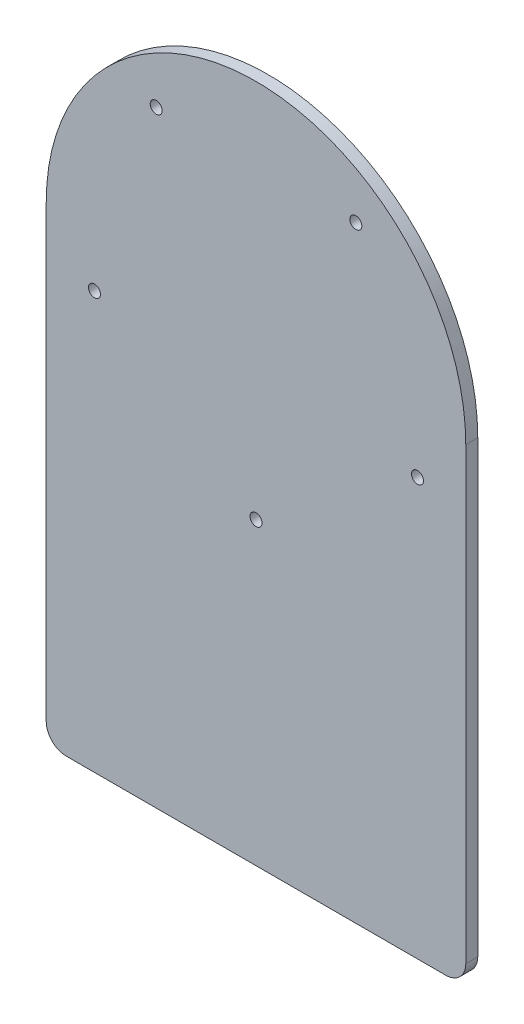
ISO-10303-21;
HEADER;
FILE_DESCRIPTION(('STEP AP214'),'2;1');
FILE_NAME('part.step','',(''),(''),'','','');
FILE_SCHEMA(('AUTOMOTIVE_DESIGN { 1 0 10303 214 1 1 1 1 }'));
ENDSEC;
DATA;
#1=APPLICATION_CONTEXT('core data for automotive mechanical design processes');
#2=APPLICATION_PROTOCOL_DEFINITION('international standard','automotive_design',2000,#1);
#3=PRODUCT_CONTEXT('',#1,'mechanical');
#4=PRODUCT('Part','Part','',(#3));
#5=PRODUCT_RELATED_PRODUCT_CATEGORY('part','',(#4));
#6=PRODUCT_DEFINITION_FORMATION('','',#4);
#7=PRODUCT_DEFINITION_CONTEXT('part definition',#1,'design');
#8=PRODUCT_DEFINITION('design','',#6,#7);
#9=PRODUCT_DEFINITION_SHAPE('','',#8);
#10=(LENGTH_UNIT() NAMED_UNIT(*) SI_UNIT(.MILLI.,.METRE.));
#11=(NAMED_UNIT(*) PLANE_ANGLE_UNIT() SI_UNIT($,.RADIAN.));
#12=(NAMED_UNIT(*) SI_UNIT($,.STERADIAN.) SOLID_ANGLE_UNIT());
#13=UNCERTAINTY_MEASURE_WITH_UNIT(LENGTH_MEASURE(1.E-05),#10,'distance_accuracy_value','');
#14=(GEOMETRIC_REPRESENTATION_CONTEXT(3) GLOBAL_UNCERTAINTY_ASSIGNED_CONTEXT((#13)) GLOBAL_UNIT_ASSIGNED_CONTEXT((#10,
#11,#12)) REPRESENTATION_CONTEXT('',''));
#15=CARTESIAN_POINT('',(0.,0.,0.));
#16=DIRECTION('',(0.,0.,1.));
#17=DIRECTION('',(1.,0.,0.));
#18=AXIS2_PLACEMENT_3D('',#15,#16,#17);
#19=CARTESIAN_POINT('',(52.5,0.,3.));
#20=DIRECTION('',(1.,0.,0.));
#21=DIRECTION('',(0.,1.,0.));
#22=AXIS2_PLACEMENT_3D('',#19,#20,#21);
#23=PLANE('',#22);
#24=DIRECTION('',(0.,-1.,0.));
#25=VECTOR('',#24,1.);
#26=CARTESIAN_POINT('',(52.5,0.,3.));
#27=LINE('',#26,#25);
#28=CARTESIAN_POINT('',(52.5,0.,3.));
#29=VERTEX_POINT('',#28);
#30=CARTESIAN_POINT('',(52.5,-112.5,3.));
#31=VERTEX_POINT('',#30);
#32=EDGE_CURVE('E101',#29,#31,#27,.T.);
#33=ORIENTED_EDGE('',*,*,#32,.T.);
#34=DIRECTION('',(0.,0.,-1.));
#35=VECTOR('',#34,1.);
#36=CARTESIAN_POINT('',(52.5,-112.5,0.));
#37=LINE('',#36,#35);
#38=CARTESIAN_POINT('',(52.5,-112.5,0.));
#39=VERTEX_POINT('',#38);
#40=EDGE_CURVE('E108',#31,#39,#37,.T.);
#41=ORIENTED_EDGE('',*,*,#40,.T.);
#42=DIRECTION('',(0.,-1.,0.));
#43=VECTOR('',#42,1.);
#44=CARTESIAN_POINT('',(52.5,0.,0.));
#45=LINE('',#44,#43);
#46=CARTESIAN_POINT('',(52.5,0.,0.));
#47=VERTEX_POINT('',#46);
#48=EDGE_CURVE('E104',#47,#39,#45,.T.);
#49=ORIENTED_EDGE('',*,*,#48,.F.);
#50=DIRECTION('',(0.,0.,-1.));
#51=VECTOR('',#50,1.);
#52=CARTESIAN_POINT('',(52.5,0.,3.));
#53=LINE('',#52,#51);
#54=EDGE_CURVE('E97',#29,#47,#53,.T.);
#55=ORIENTED_EDGE('',*,*,#54,.F.);
#56=EDGE_LOOP('',(#33,#41,#49,#55));
#57=FACE_BOUND('',#56,.T.);
#58=ADVANCED_FACE('F41',(#57),#23,.T.);
#59=CARTESIAN_POINT('',(0.,0.,3.));
#60=DIRECTION('',(0.,0.,-1.));
#61=DIRECTION('',(-1.,0.,0.));
#62=AXIS2_PLACEMENT_3D('',#59,#60,#61);
#63=CYLINDRICAL_SURFACE('',#62,52.5);
#64=CARTESIAN_POINT('',(0.,0.,0.));
#65=DIRECTION('',(0.,0.,1.));
#66=DIRECTION('',(1.,0.,0.));
#67=AXIS2_PLACEMENT_3D('',#64,#65,#66);
#68=CIRCLE('',#67,52.5);
#69=CARTESIAN_POINT('',(-52.5,0.,0.));
#70=VERTEX_POINT('',#69);
#71=EDGE_CURVE('E138',#47,#70,#68,.T.);
#72=ORIENTED_EDGE('',*,*,#71,.T.);
#73=DIRECTION('',(0.,0.,-1.));
#74=VECTOR('',#73,1.);
#75=CARTESIAN_POINT('',(-52.5,0.,3.));
#76=LINE('',#75,#74);
#77=CARTESIAN_POINT('',(-52.5,0.,3.));
#78=VERTEX_POINT('',#77);
#79=EDGE_CURVE('E109',#78,#70,#76,.T.);
#80=ORIENTED_EDGE('',*,*,#79,.F.);
#81=CARTESIAN_POINT('',(0.,0.,3.));
#82=DIRECTION('',(0.,0.,1.));
#83=DIRECTION('',(1.,0.,0.));
#84=AXIS2_PLACEMENT_3D('',#81,#82,#83);
#85=CIRCLE('',#84,52.5);
#86=EDGE_CURVE('E112',#29,#78,#85,.T.);
#87=ORIENTED_EDGE('',*,*,#86,.F.);
#88=ORIENTED_EDGE('',*,*,#54,.T.);
#89=EDGE_LOOP('',(#72,#80,#87,#88));
#90=FACE_BOUND('',#89,.T.);
#91=ADVANCED_FACE('F113',(#90),#63,.T.);
#92=CARTESIAN_POINT('',(-52.5,0.,3.));
#93=DIRECTION('',(1.,0.,0.));
#94=DIRECTION('',(0.,1.,0.));
#95=AXIS2_PLACEMENT_3D('',#92,#93,#94);
#96=PLANE('',#95);
#97=DIRECTION('',(0.,-1.,0.));
#98=VECTOR('',#97,1.);
#99=CARTESIAN_POINT('',(-52.5,0.,0.));
#100=LINE('',#99,#98);
#101=CARTESIAN_POINT('',(-52.5,-112.5,0.));
#102=VERTEX_POINT('',#101);
#103=EDGE_CURVE('E125',#70,#102,#100,.T.);
#104=ORIENTED_EDGE('',*,*,#103,.T.);
#105=DIRECTION('',(0.,0.,-1.));
#106=VECTOR('',#105,1.);
#107=CARTESIAN_POINT('',(-52.5,-112.5,3.));
#108=LINE('',#107,#106);
#109=CARTESIAN_POINT('',(-52.5,-112.5,3.));
#110=VERTEX_POINT('',#109);
#111=EDGE_CURVE('E11',#102,#110,#108,.F.);
#112=ORIENTED_EDGE('',*,*,#111,.T.);
#113=DIRECTION('',(0.,-1.,0.));
#114=VECTOR('',#113,1.);
#115=CARTESIAN_POINT('',(-52.5,0.,3.));
#116=LINE('',#115,#114);
#117=EDGE_CURVE('E117',#78,#110,#116,.T.);
#118=ORIENTED_EDGE('',*,*,#117,.F.);
#119=ORIENTED_EDGE('',*,*,#79,.T.);
#120=EDGE_LOOP('',(#104,#112,#118,#119));
#121=FACE_BOUND('',#120,.T.);
#122=ADVANCED_FACE('F171',(#121),#96,.F.);
#123=CARTESIAN_POINT('',(0.,-117.5,3.));
#124=DIRECTION('',(0.,1.,0.));
#125=DIRECTION('',(-1.,0.,0.));
#126=AXIS2_PLACEMENT_3D('',#123,#124,#125);
#127=PLANE('',#126);
#128=DIRECTION('',(1.,0.,0.));
#129=VECTOR('',#128,1.);
#130=CARTESIAN_POINT('',(0.,-117.5,0.));
#131=LINE('',#130,#129);
#132=CARTESIAN_POINT('',(-47.5,-117.5,0.));
#133=VERTEX_POINT('',#132);
#134=CARTESIAN_POINT('',(47.5,-117.5,0.));
#135=VERTEX_POINT('',#134);
#136=EDGE_CURVE('E122',#133,#135,#131,.T.);
#137=ORIENTED_EDGE('',*,*,#136,.T.);
#138=DIRECTION('',(0.,0.,-1.));
#139=VECTOR('',#138,1.);
#140=CARTESIAN_POINT('',(47.5,-117.5,3.));
#141=LINE('',#140,#139);
#142=CARTESIAN_POINT('',(47.5,-117.5,3.));
#143=VERTEX_POINT('',#142);
#144=EDGE_CURVE('E63',#135,#143,#141,.F.);
#145=ORIENTED_EDGE('',*,*,#144,.T.);
#146=DIRECTION('',(1.,0.,0.));
#147=VECTOR('',#146,1.);
#148=CARTESIAN_POINT('',(0.,-117.5,3.));
#149=LINE('',#148,#147);
#150=CARTESIAN_POINT('',(-47.5,-117.5,3.));
#151=VERTEX_POINT('',#150);
#152=EDGE_CURVE('E133',#151,#143,#149,.T.);
#153=ORIENTED_EDGE('',*,*,#152,.F.);
#154=DIRECTION('',(0.,0.,-1.));
#155=VECTOR('',#154,1.);
#156=CARTESIAN_POINT('',(-47.5,-117.5,3.));
#157=LINE('',#156,#155);
#158=EDGE_CURVE('E154',#151,#133,#157,.T.);
#159=ORIENTED_EDGE('',*,*,#158,.T.);
#160=EDGE_LOOP('',(#137,#145,#153,#159));
#161=FACE_BOUND('',#160,.T.);
#162=ADVANCED_FACE('F166',(#161),#127,.F.);
#163=CARTESIAN_POINT('',(0.,0.,3.));
#164=DIRECTION('',(0.,0.,1.));
#165=DIRECTION('',(1.,0.,0.));
#166=AXIS2_PLACEMENT_3D('',#163,#164,#165);
#167=PLANE('',#166);
#168=CARTESIAN_POINT('',(0.,-42.5,3.));
#169=DIRECTION('',(0.,0.,1.));
#170=DIRECTION('',(1.,0.,0.));
#171=AXIS2_PLACEMENT_3D('',#168,#169,#170);
#172=CIRCLE('',#171,1.5);
#173=CARTESIAN_POINT('',(1.5,-42.5,3.));
#174=VERTEX_POINT('',#173);
#175=EDGE_CURVE('E226',#174,#174,#172,.T.);
#176=ORIENTED_EDGE('',*,*,#175,.F.);
#177=EDGE_LOOP('',(#176));
#178=FACE_BOUND('',#177,.T.);
#179=CARTESIAN_POINT('',(-40.419901942544,-13.1332222609353,3.));
#180=DIRECTION('',(0.,0.,1.));
#181=DIRECTION('',(1.,0.,0.));
#182=AXIS2_PLACEMENT_3D('',#179,#180,#181);
#183=CIRCLE('',#182,1.5);
#184=CARTESIAN_POINT('',(-38.919901942544,-13.1332222609353,3.));
#185=VERTEX_POINT('',#184);
#186=EDGE_CURVE('E234',#185,#185,#183,.T.);
#187=ORIENTED_EDGE('',*,*,#186,.F.);
#188=EDGE_LOOP('',(#187));
#189=FACE_BOUND('',#188,.T.);
#190=CARTESIAN_POINT('',(-24.9808732224301,34.3832222609353,3.));
#191=DIRECTION('',(0.,0.,1.));
#192=DIRECTION('',(1.,0.,0.));
#193=AXIS2_PLACEMENT_3D('',#190,#191,#192);
#194=CIRCLE('',#193,1.5);
#195=CARTESIAN_POINT('',(-23.4808732224301,34.3832222609353,3.));
#196=VERTEX_POINT('',#195);
#197=EDGE_CURVE('E244',#196,#196,#194,.T.);
#198=ORIENTED_EDGE('',*,*,#197,.F.);
#199=EDGE_LOOP('',(#198));
#200=FACE_BOUND('',#199,.T.);
#201=CARTESIAN_POINT('',(24.9808732224301,34.3832222609353,3.));
#202=DIRECTION('',(0.,0.,1.));
#203=DIRECTION('',(1.,0.,0.));
#204=AXIS2_PLACEMENT_3D('',#201,#202,#203);
#205=CIRCLE('',#204,1.5);
#206=CARTESIAN_POINT('',(26.4808732224301,34.3832222609353,3.));
#207=VERTEX_POINT('',#206);
#208=EDGE_CURVE('E252',#207,#207,#205,.T.);
#209=ORIENTED_EDGE('',*,*,#208,.F.);
#210=EDGE_LOOP('',(#209));
#211=FACE_BOUND('',#210,.T.);
#212=CARTESIAN_POINT('',(40.419901942544,-13.1332222609353,3.));
#213=DIRECTION('',(0.,0.,1.));
#214=DIRECTION('',(1.,0.,0.));
#215=AXIS2_PLACEMENT_3D('',#212,#213,#214);
#216=CIRCLE('',#215,1.5);
#217=CARTESIAN_POINT('',(41.919901942544,-13.1332222609353,3.));
#218=VERTEX_POINT('',#217);
#219=EDGE_CURVE('E128',#218,#218,#216,.T.);
#220=ORIENTED_EDGE('',*,*,#219,.F.);
#221=EDGE_LOOP('',(#220));
#222=FACE_BOUND('',#221,.T.);
#223=ORIENTED_EDGE('',*,*,#152,.T.);
#224=CARTESIAN_POINT('',(47.5,-112.5,3.));
#225=DIRECTION('',(0.,0.,1.));
#226=DIRECTION('',(1.,0.,0.));
#227=AXIS2_PLACEMENT_3D('',#224,#225,#226);
#228=CIRCLE('',#227,5.);
#229=EDGE_CURVE('E50',#143,#31,#228,.T.);
#230=ORIENTED_EDGE('',*,*,#229,.T.);
#231=ORIENTED_EDGE('',*,*,#32,.F.);
#232=ORIENTED_EDGE('',*,*,#86,.T.);
#233=ORIENTED_EDGE('',*,*,#117,.T.);
#234=CARTESIAN_POINT('',(-47.5,-112.5,3.));
#235=DIRECTION('',(0.,0.,1.));
#236=DIRECTION('',(1.,0.,0.));
#237=AXIS2_PLACEMENT_3D('',#234,#235,#236);
#238=CIRCLE('',#237,5.);
#239=EDGE_CURVE('E160',#110,#151,#238,.T.);
#240=ORIENTED_EDGE('',*,*,#239,.T.);
#241=EDGE_LOOP('',(#223,#230,#231,#232,#233,#240));
#242=FACE_BOUND('',#241,.T.);
#243=ADVANCED_FACE('F119',(#178,#189,#200,#211,#222,#242),#167,.T.);
#244=CARTESIAN_POINT('',(0.,0.,0.));
#245=DIRECTION('',(0.,0.,1.));
#246=DIRECTION('',(1.,0.,0.));
#247=AXIS2_PLACEMENT_3D('',#244,#245,#246);
#248=PLANE('',#247);
#249=CARTESIAN_POINT('',(0.,-42.5,0.));
#250=DIRECTION('',(0.,0.,1.));
#251=DIRECTION('',(1.,0.,0.));
#252=AXIS2_PLACEMENT_3D('',#249,#250,#251);
#253=CIRCLE('',#252,1.5);
#254=CARTESIAN_POINT('',(1.5,-42.5,0.));
#255=VERTEX_POINT('',#254);
#256=EDGE_CURVE('E139',#255,#255,#253,.T.);
#257=ORIENTED_EDGE('',*,*,#256,.T.);
#258=EDGE_LOOP('',(#257));
#259=FACE_BOUND('',#258,.T.);
#260=CARTESIAN_POINT('',(-40.419901942544,-13.1332222609353,0.));
#261=DIRECTION('',(0.,0.,1.));
#262=DIRECTION('',(1.,0.,0.));
#263=AXIS2_PLACEMENT_3D('',#260,#261,#262);
#264=CIRCLE('',#263,1.5);
#265=CARTESIAN_POINT('',(-38.919901942544,-13.1332222609353,0.));
#266=VERTEX_POINT('',#265);
#267=EDGE_CURVE('E228',#266,#266,#264,.T.);
#268=ORIENTED_EDGE('',*,*,#267,.T.);
#269=EDGE_LOOP('',(#268));
#270=FACE_BOUND('',#269,.T.);
#271=CARTESIAN_POINT('',(-24.9808732224301,34.3832222609353,0.));
#272=DIRECTION('',(0.,0.,1.));
#273=DIRECTION('',(1.,0.,0.));
#274=AXIS2_PLACEMENT_3D('',#271,#272,#273);
#275=CIRCLE('',#274,1.5);
#276=CARTESIAN_POINT('',(-23.4808732224301,34.3832222609353,0.));
#277=VERTEX_POINT('',#276);
#278=EDGE_CURVE('E240',#277,#277,#275,.T.);
#279=ORIENTED_EDGE('',*,*,#278,.T.);
#280=EDGE_LOOP('',(#279));
#281=FACE_BOUND('',#280,.T.);
#282=CARTESIAN_POINT('',(24.9808732224301,34.3832222609353,0.));
#283=DIRECTION('',(0.,0.,1.));
#284=DIRECTION('',(1.,0.,0.));
#285=AXIS2_PLACEMENT_3D('',#282,#283,#284);
#286=CIRCLE('',#285,1.5);
#287=CARTESIAN_POINT('',(26.4808732224301,34.3832222609353,0.));
#288=VERTEX_POINT('',#287);
#289=EDGE_CURVE('E248',#288,#288,#286,.T.);
#290=ORIENTED_EDGE('',*,*,#289,.T.);
#291=EDGE_LOOP('',(#290));
#292=FACE_BOUND('',#291,.T.);
#293=CARTESIAN_POINT('',(40.419901942544,-13.1332222609353,0.));
#294=DIRECTION('',(0.,0.,1.));
#295=DIRECTION('',(1.,0.,0.));
#296=AXIS2_PLACEMENT_3D('',#293,#294,#295);
#297=CIRCLE('',#296,1.5);
#298=CARTESIAN_POINT('',(41.919901942544,-13.1332222609353,0.));
#299=VERTEX_POINT('',#298);
#300=EDGE_CURVE('E255',#299,#299,#297,.T.);
#301=ORIENTED_EDGE('',*,*,#300,.T.);
#302=EDGE_LOOP('',(#301));
#303=FACE_BOUND('',#302,.T.);
#304=ORIENTED_EDGE('',*,*,#48,.T.);
#305=CARTESIAN_POINT('',(47.5,-112.5,0.));
#306=DIRECTION('',(0.,0.,1.));
#307=DIRECTION('',(1.,0.,0.));
#308=AXIS2_PLACEMENT_3D('',#305,#306,#307);
#309=CIRCLE('',#308,5.);
#310=EDGE_CURVE('E151',#39,#135,#309,.F.);
#311=ORIENTED_EDGE('',*,*,#310,.T.);
#312=ORIENTED_EDGE('',*,*,#136,.F.);
#313=CARTESIAN_POINT('',(-47.5,-112.5,0.));
#314=DIRECTION('',(0.,0.,1.));
#315=DIRECTION('',(1.,0.,0.));
#316=AXIS2_PLACEMENT_3D('',#313,#314,#315);
#317=CIRCLE('',#316,5.);
#318=EDGE_CURVE('E148',#133,#102,#317,.F.);
#319=ORIENTED_EDGE('',*,*,#318,.T.);
#320=ORIENTED_EDGE('',*,*,#103,.F.);
#321=ORIENTED_EDGE('',*,*,#71,.F.);
#322=EDGE_LOOP('',(#304,#311,#312,#319,#320,#321));
#323=FACE_BOUND('',#322,.T.);
#324=ADVANCED_FACE('F170',(#259,#270,#281,#292,#303,#323),#248,.F.);
#325=CARTESIAN_POINT('',(47.5,-112.5,3.));
#326=DIRECTION('',(0.,0.,1.));
#327=DIRECTION('',(1.,0.,0.));
#328=AXIS2_PLACEMENT_3D('',#325,#326,#327);
#329=CYLINDRICAL_SURFACE('',#328,5.);
#330=ORIENTED_EDGE('',*,*,#229,.F.);
#331=ORIENTED_EDGE('',*,*,#144,.F.);
#332=ORIENTED_EDGE('',*,*,#310,.F.);
#333=ORIENTED_EDGE('',*,*,#40,.F.);
#334=EDGE_LOOP('',(#330,#331,#332,#333));
#335=FACE_BOUND('',#334,.T.);
#336=ADVANCED_FACE('F184',(#335),#329,.T.);
#337=CARTESIAN_POINT('',(-47.5,-112.5,3.));
#338=DIRECTION('',(0.,0.,-1.));
#339=DIRECTION('',(-1.,0.,0.));
#340=AXIS2_PLACEMENT_3D('',#337,#338,#339);
#341=CYLINDRICAL_SURFACE('',#340,5.);
#342=ORIENTED_EDGE('',*,*,#239,.F.);
#343=ORIENTED_EDGE('',*,*,#111,.F.);
#344=ORIENTED_EDGE('',*,*,#318,.F.);
#345=ORIENTED_EDGE('',*,*,#158,.F.);
#346=EDGE_LOOP('',(#342,#343,#344,#345));
#347=FACE_BOUND('',#346,.T.);
#348=ADVANCED_FACE('F43',(#347),#341,.T.);
#349=CARTESIAN_POINT('',(40.419901942544,-13.1332222609353,0.));
#350=DIRECTION('',(0.,0.,1.));
#351=DIRECTION('',(1.,0.,0.));
#352=AXIS2_PLACEMENT_3D('',#349,#350,#351);
#353=CYLINDRICAL_SURFACE('',#352,1.5);
#354=ORIENTED_EDGE('',*,*,#300,.F.);
#355=EDGE_LOOP('',(#354));
#356=FACE_BOUND('',#355,.T.);
#357=ORIENTED_EDGE('',*,*,#219,.T.);
#358=EDGE_LOOP('',(#357));
#359=FACE_BOUND('',#358,.T.);
#360=ADVANCED_FACE('F191',(#356,#359),#353,.F.);
#361=CARTESIAN_POINT('',(24.9808732224301,34.3832222609353,0.));
#362=DIRECTION('',(0.,0.,1.));
#363=DIRECTION('',(1.,0.,0.));
#364=AXIS2_PLACEMENT_3D('',#361,#362,#363);
#365=CYLINDRICAL_SURFACE('',#364,1.5);
#366=ORIENTED_EDGE('',*,*,#289,.F.);
#367=EDGE_LOOP('',(#366));
#368=FACE_BOUND('',#367,.T.);
#369=ORIENTED_EDGE('',*,*,#208,.T.);
#370=EDGE_LOOP('',(#369));
#371=FACE_BOUND('',#370,.T.);
#372=ADVANCED_FACE('F204',(#368,#371),#365,.F.);
#373=CARTESIAN_POINT('',(-24.9808732224301,34.3832222609353,0.));
#374=DIRECTION('',(0.,0.,1.));
#375=DIRECTION('',(1.,0.,0.));
#376=AXIS2_PLACEMENT_3D('',#373,#374,#375);
#377=CYLINDRICAL_SURFACE('',#376,1.5);
#378=ORIENTED_EDGE('',*,*,#278,.F.);
#379=EDGE_LOOP('',(#378));
#380=FACE_BOUND('',#379,.T.);
#381=ORIENTED_EDGE('',*,*,#197,.T.);
#382=EDGE_LOOP('',(#381));
#383=FACE_BOUND('',#382,.T.);
#384=ADVANCED_FACE('F208',(#380,#383),#377,.F.);
#385=CARTESIAN_POINT('',(-40.419901942544,-13.1332222609353,0.));
#386=DIRECTION('',(0.,0.,1.));
#387=DIRECTION('',(1.,0.,0.));
#388=AXIS2_PLACEMENT_3D('',#385,#386,#387);
#389=CYLINDRICAL_SURFACE('',#388,1.5);
#390=ORIENTED_EDGE('',*,*,#267,.F.);
#391=EDGE_LOOP('',(#390));
#392=FACE_BOUND('',#391,.T.);
#393=ORIENTED_EDGE('',*,*,#186,.T.);
#394=EDGE_LOOP('',(#393));
#395=FACE_BOUND('',#394,.T.);
#396=ADVANCED_FACE('F212',(#392,#395),#389,.F.);
#397=CARTESIAN_POINT('',(0.,-42.5,0.));
#398=DIRECTION('',(0.,0.,1.));
#399=DIRECTION('',(1.,0.,0.));
#400=AXIS2_PLACEMENT_3D('',#397,#398,#399);
#401=CYLINDRICAL_SURFACE('',#400,1.5);
#402=ORIENTED_EDGE('',*,*,#256,.F.);
#403=EDGE_LOOP('',(#402));
#404=FACE_BOUND('',#403,.T.);
#405=ORIENTED_EDGE('',*,*,#175,.T.);
#406=EDGE_LOOP('',(#405));
#407=FACE_BOUND('',#406,.T.);
#408=ADVANCED_FACE('F216',(#404,#407),#401,.F.);
#409=CLOSED_SHELL('',(#58,#91,#122,#162,#243,#324,#336,#348,#360,#372,#384,#396,#408));
#410=MANIFOLD_SOLID_BREP('B2',#409);
#411=ADVANCED_BREP_SHAPE_REPRESENTATION('',(#18,#410),#14);
#412=SHAPE_DEFINITION_REPRESENTATION(#9,#411);
ENDSEC;
END-ISO-10303-21;
